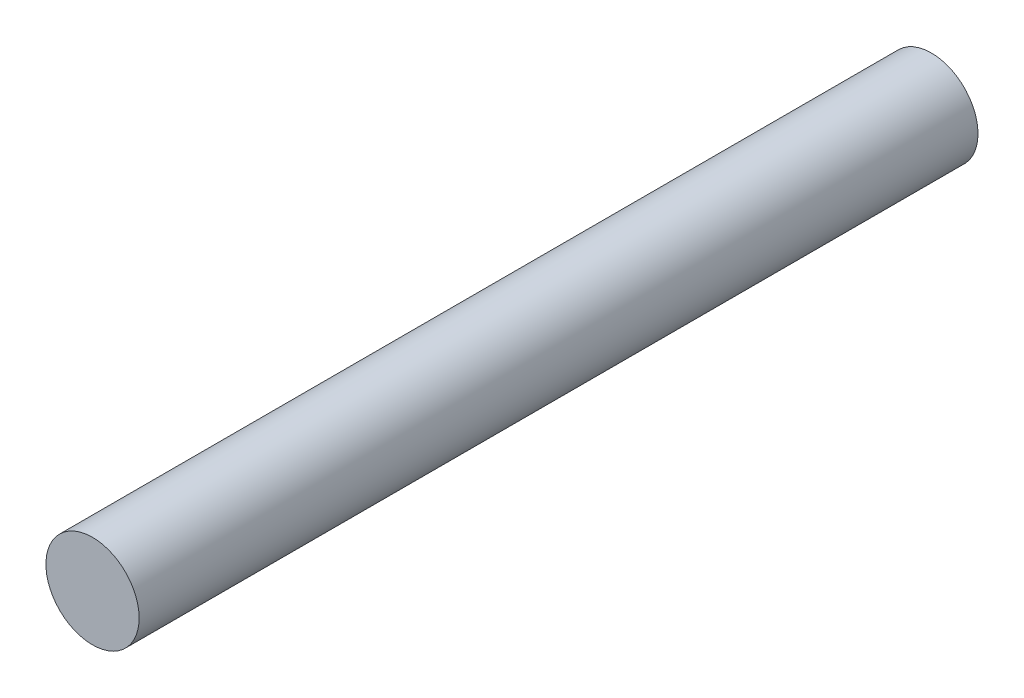
ISO-10303-21;
HEADER;
FILE_DESCRIPTION(('STEP AP214'),'2;1');
FILE_NAME('part.step','',(''),(''),'','','');
FILE_SCHEMA(('AUTOMOTIVE_DESIGN { 1 0 10303 214 1 1 1 1 }'));
ENDSEC;
DATA;
#1=APPLICATION_CONTEXT('core data for automotive mechanical design processes');
#2=APPLICATION_PROTOCOL_DEFINITION('international standard','automotive_design',2000,#1);
#3=PRODUCT_CONTEXT('',#1,'mechanical');
#4=PRODUCT('Part','Part','',(#3));
#5=PRODUCT_RELATED_PRODUCT_CATEGORY('part','',(#4));
#6=PRODUCT_DEFINITION_FORMATION('','',#4);
#7=PRODUCT_DEFINITION_CONTEXT('part definition',#1,'design');
#8=PRODUCT_DEFINITION('design','',#6,#7);
#9=PRODUCT_DEFINITION_SHAPE('','',#8);
#10=(LENGTH_UNIT() NAMED_UNIT(*) SI_UNIT(.MILLI.,.METRE.));
#11=(NAMED_UNIT(*) PLANE_ANGLE_UNIT() SI_UNIT($,.RADIAN.));
#12=(NAMED_UNIT(*) SI_UNIT($,.STERADIAN.) SOLID_ANGLE_UNIT());
#13=UNCERTAINTY_MEASURE_WITH_UNIT(LENGTH_MEASURE(1.E-05),#10,'distance_accuracy_value','');
#14=(GEOMETRIC_REPRESENTATION_CONTEXT(3) GLOBAL_UNCERTAINTY_ASSIGNED_CONTEXT((#13)) GLOBAL_UNIT_ASSIGNED_CONTEXT((#10,
#11,#12)) REPRESENTATION_CONTEXT('',''));
#15=CARTESIAN_POINT('',(0.,0.,0.));
#16=DIRECTION('',(0.,0.,1.));
#17=DIRECTION('',(1.,0.,0.));
#18=AXIS2_PLACEMENT_3D('',#15,#16,#17);
#19=CARTESIAN_POINT('',(-3.374,3.899,-9.1));
#20=DIRECTION('',(0.,0.,-1.));
#21=DIRECTION('',(-1.,0.,0.));
#22=AXIS2_PLACEMENT_3D('',#19,#20,#21);
#23=PLANE('',#22);
#24=CARTESIAN_POINT('',(-3.675,4.2,-9.1));
#25=DIRECTION('',(0.,0.,1.));
#26=DIRECTION('',(1.,0.,0.));
#27=AXIS2_PLACEMENT_3D('',#24,#25,#26);
#28=CIRCLE('',#27,0.3);
#29=CARTESIAN_POINT('',(-3.375,4.2,-9.1));
#30=VERTEX_POINT('',#29);
#31=EDGE_CURVE('E19',#30,#30,#28,.T.);
#32=ORIENTED_EDGE('',*,*,#31,.F.);
#33=EDGE_LOOP('',(#32));
#34=FACE_BOUND('',#33,.T.);
#35=ADVANCED_FACE('F15',(#34),#23,.T.);
#36=CARTESIAN_POINT('',(-3.675,4.2,-9.1));
#37=DIRECTION('',(0.,0.,1.));
#38=DIRECTION('',(1.,0.,0.));
#39=AXIS2_PLACEMENT_3D('',#36,#37,#38);
#40=CYLINDRICAL_SURFACE('',#39,0.3);
#41=CARTESIAN_POINT('',(-3.675,4.2,-3.7));
#42=DIRECTION('',(0.,0.,1.));
#43=DIRECTION('',(1.,0.,0.));
#44=AXIS2_PLACEMENT_3D('',#41,#42,#43);
#45=CIRCLE('',#44,0.3);
#46=CARTESIAN_POINT('',(-3.375,4.2,-3.7));
#47=VERTEX_POINT('',#46);
#48=EDGE_CURVE('E10',#47,#47,#45,.T.);
#49=ORIENTED_EDGE('',*,*,#48,.F.);
#50=EDGE_LOOP('',(#49));
#51=FACE_BOUND('',#50,.T.);
#52=ORIENTED_EDGE('',*,*,#31,.T.);
#53=EDGE_LOOP('',(#52));
#54=FACE_BOUND('',#53,.T.);
#55=ADVANCED_FACE('F28',(#51,#54),#40,.T.);
#56=CARTESIAN_POINT('',(-3.374,4.501,-3.7));
#57=DIRECTION('',(0.,0.,1.));
#58=DIRECTION('',(-1.,0.,0.));
#59=AXIS2_PLACEMENT_3D('',#56,#57,#58);
#60=PLANE('',#59);
#61=ORIENTED_EDGE('',*,*,#48,.T.);
#62=EDGE_LOOP('',(#61));
#63=FACE_BOUND('',#62,.T.);
#64=ADVANCED_FACE('F17',(#63),#60,.T.);
#65=CLOSED_SHELL('',(#35,#55,#64));
#66=MANIFOLD_SOLID_BREP('B1',#65);
#67=ADVANCED_BREP_SHAPE_REPRESENTATION('',(#18,#66),#14);
#68=SHAPE_DEFINITION_REPRESENTATION(#9,#67);
ENDSEC;
END-ISO-10303-21;
